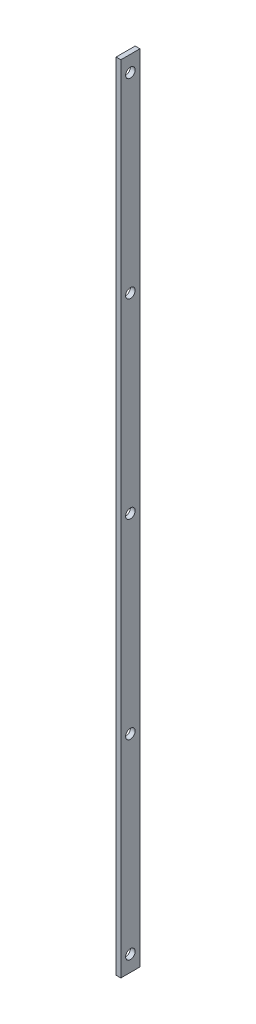
ISO-10303-21;
HEADER;
FILE_DESCRIPTION(('STEP AP214'),'2;1');
FILE_NAME('part.step','',(''),(''),'','','');
FILE_SCHEMA(('AUTOMOTIVE_DESIGN { 1 0 10303 214 1 1 1 1 }'));
ENDSEC;
DATA;
#1=APPLICATION_CONTEXT('core data for automotive mechanical design processes');
#2=APPLICATION_PROTOCOL_DEFINITION('international standard','automotive_design',2000,#1);
#3=PRODUCT_CONTEXT('',#1,'mechanical');
#4=PRODUCT('Part','Part','',(#3));
#5=PRODUCT_RELATED_PRODUCT_CATEGORY('part','',(#4));
#6=PRODUCT_DEFINITION_FORMATION('','',#4);
#7=PRODUCT_DEFINITION_CONTEXT('part definition',#1,'design');
#8=PRODUCT_DEFINITION('design','',#6,#7);
#9=PRODUCT_DEFINITION_SHAPE('','',#8);
#10=(LENGTH_UNIT() NAMED_UNIT(*) SI_UNIT(.MILLI.,.METRE.));
#11=(NAMED_UNIT(*) PLANE_ANGLE_UNIT() SI_UNIT($,.RADIAN.));
#12=(NAMED_UNIT(*) SI_UNIT($,.STERADIAN.) SOLID_ANGLE_UNIT());
#13=UNCERTAINTY_MEASURE_WITH_UNIT(LENGTH_MEASURE(1.E-05),#10,'distance_accuracy_value','');
#14=(GEOMETRIC_REPRESENTATION_CONTEXT(3) GLOBAL_UNCERTAINTY_ASSIGNED_CONTEXT((#13)) GLOBAL_UNIT_ASSIGNED_CONTEXT((#10,
#11,#12)) REPRESENTATION_CONTEXT('',''));
#15=CARTESIAN_POINT('',(0.,0.,0.));
#16=DIRECTION('',(0.,0.,1.));
#17=DIRECTION('',(1.,0.,0.));
#18=AXIS2_PLACEMENT_3D('',#15,#16,#17);
#19=CARTESIAN_POINT('',(3.,-250.,-6.));
#20=DIRECTION('',(0.,0.,1.));
#21=DIRECTION('',(1.,0.,0.));
#22=AXIS2_PLACEMENT_3D('',#19,#20,#21);
#23=PLANE('',#22);
#24=DIRECTION('',(0.,1.,0.));
#25=VECTOR('',#24,1.);
#26=CARTESIAN_POINT('',(0.,-250.,-6.));
#27=LINE('',#26,#25);
#28=CARTESIAN_POINT('',(0.,-250.,-6.));
#29=VERTEX_POINT('',#28);
#30=CARTESIAN_POINT('',(0.,250.,-6.));
#31=VERTEX_POINT('',#30);
#32=EDGE_CURVE('E95',#29,#31,#27,.T.);
#33=ORIENTED_EDGE('',*,*,#32,.T.);
#34=DIRECTION('',(-1.,0.,0.));
#35=VECTOR('',#34,1.);
#36=CARTESIAN_POINT('',(3.,250.,-6.));
#37=LINE('',#36,#35);
#38=CARTESIAN_POINT('',(3.,250.,-6.));
#39=VERTEX_POINT('',#38);
#40=EDGE_CURVE('E11',#39,#31,#37,.T.);
#41=ORIENTED_EDGE('',*,*,#40,.F.);
#42=DIRECTION('',(0.,1.,0.));
#43=VECTOR('',#42,1.);
#44=CARTESIAN_POINT('',(3.,-250.,-6.));
#45=LINE('',#44,#43);
#46=CARTESIAN_POINT('',(3.,-250.,-6.));
#47=VERTEX_POINT('',#46);
#48=EDGE_CURVE('E83',#47,#39,#45,.T.);
#49=ORIENTED_EDGE('',*,*,#48,.F.);
#50=DIRECTION('',(-1.,0.,0.));
#51=VECTOR('',#50,1.);
#52=CARTESIAN_POINT('',(3.,-250.,-6.));
#53=LINE('',#52,#51);
#54=EDGE_CURVE('E91',#47,#29,#53,.T.);
#55=ORIENTED_EDGE('',*,*,#54,.T.);
#56=EDGE_LOOP('',(#33,#41,#49,#55));
#57=FACE_BOUND('',#56,.T.);
#58=ADVANCED_FACE('F32',(#57),#23,.F.);
#59=CARTESIAN_POINT('',(3.,250.,6.));
#60=DIRECTION('',(0.,-1.,0.));
#61=DIRECTION('',(0.,0.,-1.));
#62=AXIS2_PLACEMENT_3D('',#59,#60,#61);
#63=PLANE('',#62);
#64=DIRECTION('',(0.,0.,1.));
#65=VECTOR('',#64,1.);
#66=CARTESIAN_POINT('',(0.,250.,6.));
#67=LINE('',#66,#65);
#68=CARTESIAN_POINT('',(0.,250.,6.));
#69=VERTEX_POINT('',#68);
#70=EDGE_CURVE('E87',#31,#69,#67,.T.);
#71=ORIENTED_EDGE('',*,*,#70,.T.);
#72=DIRECTION('',(-1.,0.,0.));
#73=VECTOR('',#72,1.);
#74=CARTESIAN_POINT('',(3.,250.,6.));
#75=LINE('',#74,#73);
#76=CARTESIAN_POINT('',(3.,250.,6.));
#77=VERTEX_POINT('',#76);
#78=EDGE_CURVE('E40',#77,#69,#75,.T.);
#79=ORIENTED_EDGE('',*,*,#78,.F.);
#80=DIRECTION('',(0.,0.,1.));
#81=VECTOR('',#80,1.);
#82=CARTESIAN_POINT('',(3.,250.,6.));
#83=LINE('',#82,#81);
#84=EDGE_CURVE('E78',#39,#77,#83,.T.);
#85=ORIENTED_EDGE('',*,*,#84,.F.);
#86=ORIENTED_EDGE('',*,*,#40,.T.);
#87=EDGE_LOOP('',(#71,#79,#85,#86));
#88=FACE_BOUND('',#87,.T.);
#89=ADVANCED_FACE('F86',(#88),#63,.F.);
#90=CARTESIAN_POINT('',(3.,-250.,6.));
#91=DIRECTION('',(0.,0.,-1.));
#92=DIRECTION('',(-1.,0.,0.));
#93=AXIS2_PLACEMENT_3D('',#90,#91,#92);
#94=PLANE('',#93);
#95=DIRECTION('',(0.,-1.,0.));
#96=VECTOR('',#95,1.);
#97=CARTESIAN_POINT('',(0.,-250.,6.));
#98=LINE('',#97,#96);
#99=CARTESIAN_POINT('',(0.,-250.,6.));
#100=VERTEX_POINT('',#99);
#101=EDGE_CURVE('E65',#69,#100,#98,.T.);
#102=ORIENTED_EDGE('',*,*,#101,.T.);
#103=DIRECTION('',(-1.,0.,0.));
#104=VECTOR('',#103,1.);
#105=CARTESIAN_POINT('',(3.,-250.,6.));
#106=LINE('',#105,#104);
#107=CARTESIAN_POINT('',(3.,-250.,6.));
#108=VERTEX_POINT('',#107);
#109=EDGE_CURVE('E88',#108,#100,#106,.T.);
#110=ORIENTED_EDGE('',*,*,#109,.F.);
#111=DIRECTION('',(0.,-1.,0.));
#112=VECTOR('',#111,1.);
#113=CARTESIAN_POINT('',(3.,-250.,6.));
#114=LINE('',#113,#112);
#115=EDGE_CURVE('E81',#77,#108,#114,.T.);
#116=ORIENTED_EDGE('',*,*,#115,.F.);
#117=ORIENTED_EDGE('',*,*,#78,.T.);
#118=EDGE_LOOP('',(#102,#110,#116,#117));
#119=FACE_BOUND('',#118,.T.);
#120=ADVANCED_FACE('F89',(#119),#94,.F.);
#121=CARTESIAN_POINT('',(3.,-250.,6.));
#122=DIRECTION('',(0.,1.,0.));
#123=DIRECTION('',(0.,0.,1.));
#124=AXIS2_PLACEMENT_3D('',#121,#122,#123);
#125=PLANE('',#124);
#126=DIRECTION('',(0.,0.,-1.));
#127=VECTOR('',#126,1.);
#128=CARTESIAN_POINT('',(0.,-250.,6.));
#129=LINE('',#128,#127);
#130=EDGE_CURVE('E71',#100,#29,#129,.T.);
#131=ORIENTED_EDGE('',*,*,#130,.T.);
#132=ORIENTED_EDGE('',*,*,#54,.F.);
#133=DIRECTION('',(0.,0.,-1.));
#134=VECTOR('',#133,1.);
#135=CARTESIAN_POINT('',(3.,-250.,6.));
#136=LINE('',#135,#134);
#137=EDGE_CURVE('E48',#108,#47,#136,.T.);
#138=ORIENTED_EDGE('',*,*,#137,.F.);
#139=ORIENTED_EDGE('',*,*,#109,.T.);
#140=EDGE_LOOP('',(#131,#132,#138,#139));
#141=FACE_BOUND('',#140,.T.);
#142=ADVANCED_FACE('F103',(#141),#125,.F.);
#143=CARTESIAN_POINT('',(3.,0.,0.));
#144=DIRECTION('',(-1.,0.,0.));
#145=DIRECTION('',(0.,0.,1.));
#146=AXIS2_PLACEMENT_3D('',#143,#144,#145);
#147=PLANE('',#146);
#148=CARTESIAN_POINT('',(3.,-240.,5.02773312793411E-12));
#149=DIRECTION('',(-1.,0.,0.));
#150=DIRECTION('',(0.,0.,1.));
#151=AXIS2_PLACEMENT_3D('',#148,#149,#150);
#152=CIRCLE('',#151,3.);
#153=CARTESIAN_POINT('',(3.,-240.,3.00000000000502));
#154=VERTEX_POINT('',#153);
#155=EDGE_CURVE('E132',#154,#154,#152,.F.);
#156=ORIENTED_EDGE('',*,*,#155,.F.);
#157=EDGE_LOOP('',(#156));
#158=FACE_BOUND('',#157,.T.);
#159=CARTESIAN_POINT('',(3.,-120.,3.77079984595058E-12));
#160=DIRECTION('',(-1.,0.,0.));
#161=DIRECTION('',(0.,0.,1.));
#162=AXIS2_PLACEMENT_3D('',#159,#160,#161);
#163=CIRCLE('',#162,3.);
#164=CARTESIAN_POINT('',(3.,-120.,3.00000000000377));
#165=VERTEX_POINT('',#164);
#166=EDGE_CURVE('E126',#165,#165,#163,.F.);
#167=ORIENTED_EDGE('',*,*,#166,.F.);
#168=EDGE_LOOP('',(#167));
#169=FACE_BOUND('',#168,.T.);
#170=CARTESIAN_POINT('',(3.,0.,2.51386656396706E-12));
#171=DIRECTION('',(-1.,0.,0.));
#172=DIRECTION('',(0.,0.,1.));
#173=AXIS2_PLACEMENT_3D('',#170,#171,#172);
#174=CIRCLE('',#173,3.);
#175=CARTESIAN_POINT('',(3.,0.,3.00000000000252));
#176=VERTEX_POINT('',#175);
#177=EDGE_CURVE('E120',#176,#176,#174,.F.);
#178=ORIENTED_EDGE('',*,*,#177,.F.);
#179=EDGE_LOOP('',(#178));
#180=FACE_BOUND('',#179,.T.);
#181=CARTESIAN_POINT('',(3.,120.,1.25693328198353E-12));
#182=DIRECTION('',(-1.,0.,0.));
#183=DIRECTION('',(0.,0.,1.));
#184=AXIS2_PLACEMENT_3D('',#181,#182,#183);
#185=CIRCLE('',#184,3.);
#186=CARTESIAN_POINT('',(3.,120.,3.00000000000126));
#187=VERTEX_POINT('',#186);
#188=EDGE_CURVE('E114',#187,#187,#185,.F.);
#189=ORIENTED_EDGE('',*,*,#188,.F.);
#190=EDGE_LOOP('',(#189));
#191=FACE_BOUND('',#190,.T.);
#192=CARTESIAN_POINT('',(3.,240.,0.));
#193=DIRECTION('',(-1.,0.,0.));
#194=DIRECTION('',(0.,0.,1.));
#195=AXIS2_PLACEMENT_3D('',#192,#193,#194);
#196=CIRCLE('',#195,3.);
#197=CARTESIAN_POINT('',(3.,240.,3.));
#198=VERTEX_POINT('',#197);
#199=EDGE_CURVE('E98',#198,#198,#196,.F.);
#200=ORIENTED_EDGE('',*,*,#199,.F.);
#201=EDGE_LOOP('',(#200));
#202=FACE_BOUND('',#201,.T.);
#203=ORIENTED_EDGE('',*,*,#48,.T.);
#204=ORIENTED_EDGE('',*,*,#84,.T.);
#205=ORIENTED_EDGE('',*,*,#115,.T.);
#206=ORIENTED_EDGE('',*,*,#137,.T.);
#207=EDGE_LOOP('',(#203,#204,#205,#206));
#208=FACE_BOUND('',#207,.T.);
#209=ADVANCED_FACE('F79',(#158,#169,#180,#191,#202,#208),#147,.F.);
#210=CARTESIAN_POINT('',(0.,0.,0.));
#211=DIRECTION('',(-1.,0.,0.));
#212=DIRECTION('',(0.,0.,1.));
#213=AXIS2_PLACEMENT_3D('',#210,#211,#212);
#214=PLANE('',#213);
#215=CARTESIAN_POINT('',(0.,-240.,5.02773312793411E-12));
#216=DIRECTION('',(-1.,0.,0.));
#217=DIRECTION('',(0.,0.,1.));
#218=AXIS2_PLACEMENT_3D('',#215,#216,#217);
#219=CIRCLE('',#218,3.);
#220=CARTESIAN_POINT('',(0.,-240.,3.00000000000502));
#221=VERTEX_POINT('',#220);
#222=EDGE_CURVE('E135',#221,#221,#219,.T.);
#223=ORIENTED_EDGE('',*,*,#222,.F.);
#224=EDGE_LOOP('',(#223));
#225=FACE_BOUND('',#224,.T.);
#226=CARTESIAN_POINT('',(0.,-120.,3.77079984595058E-12));
#227=DIRECTION('',(-1.,0.,0.));
#228=DIRECTION('',(0.,0.,1.));
#229=AXIS2_PLACEMENT_3D('',#226,#227,#228);
#230=CIRCLE('',#229,3.);
#231=CARTESIAN_POINT('',(0.,-120.,3.00000000000377));
#232=VERTEX_POINT('',#231);
#233=EDGE_CURVE('E129',#232,#232,#230,.T.);
#234=ORIENTED_EDGE('',*,*,#233,.F.);
#235=EDGE_LOOP('',(#234));
#236=FACE_BOUND('',#235,.T.);
#237=CARTESIAN_POINT('',(0.,0.,2.51386656396706E-12));
#238=DIRECTION('',(-1.,0.,0.));
#239=DIRECTION('',(0.,0.,1.));
#240=AXIS2_PLACEMENT_3D('',#237,#238,#239);
#241=CIRCLE('',#240,3.);
#242=CARTESIAN_POINT('',(0.,0.,3.00000000000252));
#243=VERTEX_POINT('',#242);
#244=EDGE_CURVE('E123',#243,#243,#241,.T.);
#245=ORIENTED_EDGE('',*,*,#244,.F.);
#246=EDGE_LOOP('',(#245));
#247=FACE_BOUND('',#246,.T.);
#248=CARTESIAN_POINT('',(0.,120.,1.25693328198353E-12));
#249=DIRECTION('',(-1.,0.,0.));
#250=DIRECTION('',(0.,0.,1.));
#251=AXIS2_PLACEMENT_3D('',#248,#249,#250);
#252=CIRCLE('',#251,3.);
#253=CARTESIAN_POINT('',(0.,120.,3.00000000000126));
#254=VERTEX_POINT('',#253);
#255=EDGE_CURVE('E117',#254,#254,#252,.T.);
#256=ORIENTED_EDGE('',*,*,#255,.F.);
#257=EDGE_LOOP('',(#256));
#258=FACE_BOUND('',#257,.T.);
#259=CARTESIAN_POINT('',(0.,240.,0.));
#260=DIRECTION('',(-1.,0.,0.));
#261=DIRECTION('',(0.,0.,1.));
#262=AXIS2_PLACEMENT_3D('',#259,#260,#261);
#263=CIRCLE('',#262,3.);
#264=CARTESIAN_POINT('',(0.,240.,3.));
#265=VERTEX_POINT('',#264);
#266=EDGE_CURVE('E111',#265,#265,#263,.T.);
#267=ORIENTED_EDGE('',*,*,#266,.F.);
#268=EDGE_LOOP('',(#267));
#269=FACE_BOUND('',#268,.T.);
#270=ORIENTED_EDGE('',*,*,#32,.F.);
#271=ORIENTED_EDGE('',*,*,#130,.F.);
#272=ORIENTED_EDGE('',*,*,#101,.F.);
#273=ORIENTED_EDGE('',*,*,#70,.F.);
#274=EDGE_LOOP('',(#270,#271,#272,#273));
#275=FACE_BOUND('',#274,.T.);
#276=ADVANCED_FACE('F106',(#225,#236,#247,#258,#269,#275),#214,.T.);
#277=CARTESIAN_POINT('',(11.4852813742386,240.,0.));
#278=DIRECTION('',(-1.,0.,0.));
#279=DIRECTION('',(0.,0.,1.));
#280=AXIS2_PLACEMENT_3D('',#277,#278,#279);
#281=CYLINDRICAL_SURFACE('',#280,3.);
#282=ORIENTED_EDGE('',*,*,#199,.T.);
#283=EDGE_LOOP('',(#282));
#284=FACE_BOUND('',#283,.T.);
#285=ORIENTED_EDGE('',*,*,#266,.T.);
#286=EDGE_LOOP('',(#285));
#287=FACE_BOUND('',#286,.T.);
#288=ADVANCED_FACE('F143',(#284,#287),#281,.F.);
#289=CARTESIAN_POINT('',(11.4852813742386,120.,1.25693328198353E-12));
#290=DIRECTION('',(-1.,0.,0.));
#291=DIRECTION('',(0.,0.,1.));
#292=AXIS2_PLACEMENT_3D('',#289,#290,#291);
#293=CYLINDRICAL_SURFACE('',#292,3.);
#294=ORIENTED_EDGE('',*,*,#188,.T.);
#295=EDGE_LOOP('',(#294));
#296=FACE_BOUND('',#295,.T.);
#297=ORIENTED_EDGE('',*,*,#255,.T.);
#298=EDGE_LOOP('',(#297));
#299=FACE_BOUND('',#298,.T.);
#300=ADVANCED_FACE('F154',(#296,#299),#293,.F.);
#301=CARTESIAN_POINT('',(11.4852813742386,0.,2.51386656396706E-12));
#302=DIRECTION('',(-1.,0.,0.));
#303=DIRECTION('',(0.,0.,1.));
#304=AXIS2_PLACEMENT_3D('',#301,#302,#303);
#305=CYLINDRICAL_SURFACE('',#304,3.);
#306=ORIENTED_EDGE('',*,*,#177,.T.);
#307=EDGE_LOOP('',(#306));
#308=FACE_BOUND('',#307,.T.);
#309=ORIENTED_EDGE('',*,*,#244,.T.);
#310=EDGE_LOOP('',(#309));
#311=FACE_BOUND('',#310,.T.);
#312=ADVANCED_FACE('F160',(#308,#311),#305,.F.);
#313=CARTESIAN_POINT('',(11.4852813742386,-120.,3.77079984595058E-12));
#314=DIRECTION('',(-1.,0.,0.));
#315=DIRECTION('',(0.,0.,1.));
#316=AXIS2_PLACEMENT_3D('',#313,#314,#315);
#317=CYLINDRICAL_SURFACE('',#316,3.);
#318=ORIENTED_EDGE('',*,*,#166,.T.);
#319=EDGE_LOOP('',(#318));
#320=FACE_BOUND('',#319,.T.);
#321=ORIENTED_EDGE('',*,*,#233,.T.);
#322=EDGE_LOOP('',(#321));
#323=FACE_BOUND('',#322,.T.);
#324=ADVANCED_FACE('F191',(#320,#323),#317,.F.);
#325=CARTESIAN_POINT('',(11.4852813742386,-240.,5.02773312793411E-12));
#326=DIRECTION('',(-1.,0.,0.));
#327=DIRECTION('',(0.,0.,1.));
#328=AXIS2_PLACEMENT_3D('',#325,#326,#327);
#329=CYLINDRICAL_SURFACE('',#328,3.);
#330=ORIENTED_EDGE('',*,*,#155,.T.);
#331=EDGE_LOOP('',(#330));
#332=FACE_BOUND('',#331,.T.);
#333=ORIENTED_EDGE('',*,*,#222,.T.);
#334=EDGE_LOOP('',(#333));
#335=FACE_BOUND('',#334,.T.);
#336=ADVANCED_FACE('F139',(#332,#335),#329,.F.);
#337=CLOSED_SHELL('',(#58,#89,#120,#142,#209,#276,#288,#300,#312,#324,#336));
#338=MANIFOLD_SOLID_BREP('B2',#337);
#339=ADVANCED_BREP_SHAPE_REPRESENTATION('',(#18,#338),#14);
#340=SHAPE_DEFINITION_REPRESENTATION(#9,#339);
ENDSEC;
END-ISO-10303-21;
